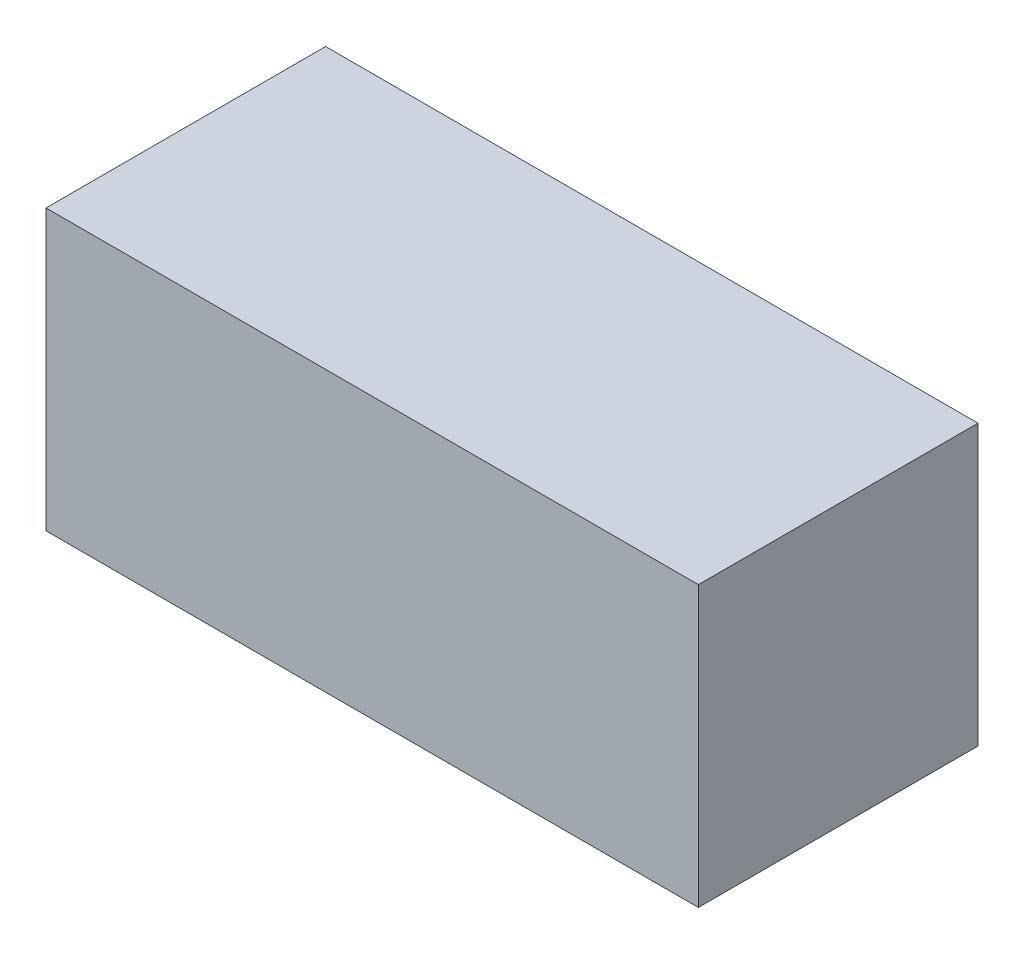
ISO-10303-21;
HEADER;
FILE_DESCRIPTION(('STEP AP214'),'2;1');
FILE_NAME('part.step','',(''),(''),'','','');
FILE_SCHEMA(('AUTOMOTIVE_DESIGN { 1 0 10303 214 1 1 1 1 }'));
ENDSEC;
DATA;
#1=APPLICATION_CONTEXT('core data for automotive mechanical design processes');
#2=APPLICATION_PROTOCOL_DEFINITION('international standard','automotive_design',2000,#1);
#3=PRODUCT_CONTEXT('',#1,'mechanical');
#4=PRODUCT('Part','Part','',(#3));
#5=PRODUCT_RELATED_PRODUCT_CATEGORY('part','',(#4));
#6=PRODUCT_DEFINITION_FORMATION('','',#4);
#7=PRODUCT_DEFINITION_CONTEXT('part definition',#1,'design');
#8=PRODUCT_DEFINITION('design','',#6,#7);
#9=PRODUCT_DEFINITION_SHAPE('','',#8);
#10=(LENGTH_UNIT() NAMED_UNIT(*) SI_UNIT(.MILLI.,.METRE.));
#11=(NAMED_UNIT(*) PLANE_ANGLE_UNIT() SI_UNIT($,.RADIAN.));
#12=(NAMED_UNIT(*) SI_UNIT($,.STERADIAN.) SOLID_ANGLE_UNIT());
#13=UNCERTAINTY_MEASURE_WITH_UNIT(LENGTH_MEASURE(1.E-05),#10,'distance_accuracy_value','');
#14=(GEOMETRIC_REPRESENTATION_CONTEXT(3) GLOBAL_UNCERTAINTY_ASSIGNED_CONTEXT((#13)) GLOBAL_UNIT_ASSIGNED_CONTEXT((#10,
#11,#12)) REPRESENTATION_CONTEXT('',''));
#15=CARTESIAN_POINT('',(0.,0.,0.));
#16=DIRECTION('',(0.,0.,1.));
#17=DIRECTION('',(1.,0.,0.));
#18=AXIS2_PLACEMENT_3D('',#15,#16,#17);
#19=CARTESIAN_POINT('',(44.45,38.1,19.05));
#20=DIRECTION('',(-1.,0.,0.));
#21=DIRECTION('',(0.,0.,1.));
#22=AXIS2_PLACEMENT_3D('',#19,#20,#21);
#23=PLANE('',#22);
#24=DIRECTION('',(0.,0.,-1.));
#25=VECTOR('',#24,1.);
#26=CARTESIAN_POINT('',(44.45,0.,19.05));
#27=LINE('',#26,#25);
#28=CARTESIAN_POINT('',(44.45,0.,19.05));
#29=VERTEX_POINT('',#28);
#30=CARTESIAN_POINT('',(44.45,0.,-19.05));
#31=VERTEX_POINT('',#30);
#32=EDGE_CURVE('E113',#29,#31,#27,.T.);
#33=ORIENTED_EDGE('',*,*,#32,.T.);
#34=DIRECTION('',(0.,-1.,0.));
#35=VECTOR('',#34,1.);
#36=CARTESIAN_POINT('',(44.45,38.1,-19.05));
#37=LINE('',#36,#35);
#38=CARTESIAN_POINT('',(44.45,38.1,-19.05));
#39=VERTEX_POINT('',#38);
#40=EDGE_CURVE('E11',#39,#31,#37,.T.);
#41=ORIENTED_EDGE('',*,*,#40,.F.);
#42=DIRECTION('',(0.,0.,-1.));
#43=VECTOR('',#42,1.);
#44=CARTESIAN_POINT('',(44.45,38.1,19.05));
#45=LINE('',#44,#43);
#46=CARTESIAN_POINT('',(44.45,38.1,19.05));
#47=VERTEX_POINT('',#46);
#48=EDGE_CURVE('E97',#47,#39,#45,.T.);
#49=ORIENTED_EDGE('',*,*,#48,.F.);
#50=DIRECTION('',(0.,-1.,0.));
#51=VECTOR('',#50,1.);
#52=CARTESIAN_POINT('',(44.45,38.1,19.05));
#53=LINE('',#52,#51);
#54=EDGE_CURVE('E109',#47,#29,#53,.T.);
#55=ORIENTED_EDGE('',*,*,#54,.T.);
#56=EDGE_LOOP('',(#33,#41,#49,#55));
#57=FACE_BOUND('',#56,.T.);
#58=ADVANCED_FACE('F45',(#57),#23,.F.);
#59=CARTESIAN_POINT('',(-44.45,38.1,-19.05));
#60=DIRECTION('',(0.,0.,1.));
#61=DIRECTION('',(1.,0.,0.));
#62=AXIS2_PLACEMENT_3D('',#59,#60,#61);
#63=PLANE('',#62);
#64=DIRECTION('',(-1.,0.,0.));
#65=VECTOR('',#64,1.);
#66=CARTESIAN_POINT('',(-44.45,0.,-19.05));
#67=LINE('',#66,#65);
#68=CARTESIAN_POINT('',(-44.45,0.,-19.05));
#69=VERTEX_POINT('',#68);
#70=EDGE_CURVE('E102',#31,#69,#67,.T.);
#71=ORIENTED_EDGE('',*,*,#70,.T.);
#72=DIRECTION('',(0.,-1.,0.));
#73=VECTOR('',#72,1.);
#74=CARTESIAN_POINT('',(-44.45,38.1,-19.05));
#75=LINE('',#74,#73);
#76=CARTESIAN_POINT('',(-44.45,38.1,-19.05));
#77=VERTEX_POINT('',#76);
#78=EDGE_CURVE('E54',#77,#69,#75,.T.);
#79=ORIENTED_EDGE('',*,*,#78,.F.);
#80=DIRECTION('',(-1.,0.,0.));
#81=VECTOR('',#80,1.);
#82=CARTESIAN_POINT('',(-44.45,38.1,-19.05));
#83=LINE('',#82,#81);
#84=EDGE_CURVE('E92',#39,#77,#83,.T.);
#85=ORIENTED_EDGE('',*,*,#84,.F.);
#86=ORIENTED_EDGE('',*,*,#40,.T.);
#87=EDGE_LOOP('',(#71,#79,#85,#86));
#88=FACE_BOUND('',#87,.T.);
#89=ADVANCED_FACE('F101',(#88),#63,.F.);
#90=CARTESIAN_POINT('',(-44.45,38.1,19.05));
#91=DIRECTION('',(1.,0.,0.));
#92=DIRECTION('',(0.,0.,-1.));
#93=AXIS2_PLACEMENT_3D('',#90,#91,#92);
#94=PLANE('',#93);
#95=DIRECTION('',(0.,0.,1.));
#96=VECTOR('',#95,1.);
#97=CARTESIAN_POINT('',(-44.45,0.,19.05));
#98=LINE('',#97,#96);
#99=CARTESIAN_POINT('',(-44.45,0.,19.05));
#100=VERTEX_POINT('',#99);
#101=EDGE_CURVE('E79',#69,#100,#98,.T.);
#102=ORIENTED_EDGE('',*,*,#101,.T.);
#103=DIRECTION('',(0.,-1.,0.));
#104=VECTOR('',#103,1.);
#105=CARTESIAN_POINT('',(-44.45,38.1,19.05));
#106=LINE('',#105,#104);
#107=CARTESIAN_POINT('',(-44.45,38.1,19.05));
#108=VERTEX_POINT('',#107);
#109=EDGE_CURVE('E104',#108,#100,#106,.T.);
#110=ORIENTED_EDGE('',*,*,#109,.F.);
#111=DIRECTION('',(0.,0.,1.));
#112=VECTOR('',#111,1.);
#113=CARTESIAN_POINT('',(-44.45,38.1,19.05));
#114=LINE('',#113,#112);
#115=EDGE_CURVE('E95',#77,#108,#114,.T.);
#116=ORIENTED_EDGE('',*,*,#115,.F.);
#117=ORIENTED_EDGE('',*,*,#78,.T.);
#118=EDGE_LOOP('',(#102,#110,#116,#117));
#119=FACE_BOUND('',#118,.T.);
#120=ADVANCED_FACE('F105',(#119),#94,.F.);
#121=CARTESIAN_POINT('',(-44.45,38.1,19.05));
#122=DIRECTION('',(0.,0.,-1.));
#123=DIRECTION('',(-1.,0.,0.));
#124=AXIS2_PLACEMENT_3D('',#121,#122,#123);
#125=PLANE('',#124);
#126=DIRECTION('',(1.,0.,0.));
#127=VECTOR('',#126,1.);
#128=CARTESIAN_POINT('',(-44.45,0.,19.05));
#129=LINE('',#128,#127);
#130=EDGE_CURVE('E85',#100,#29,#129,.T.);
#131=ORIENTED_EDGE('',*,*,#130,.T.);
#132=ORIENTED_EDGE('',*,*,#54,.F.);
#133=DIRECTION('',(1.,0.,0.));
#134=VECTOR('',#133,1.);
#135=CARTESIAN_POINT('',(-44.45,38.1,19.05));
#136=LINE('',#135,#134);
#137=EDGE_CURVE('E62',#108,#47,#136,.T.);
#138=ORIENTED_EDGE('',*,*,#137,.F.);
#139=ORIENTED_EDGE('',*,*,#109,.T.);
#140=EDGE_LOOP('',(#131,#132,#138,#139));
#141=FACE_BOUND('',#140,.T.);
#142=ADVANCED_FACE('F126',(#141),#125,.F.);
#143=CARTESIAN_POINT('',(0.,38.1,0.));
#144=DIRECTION('',(0.,-1.,0.));
#145=DIRECTION('',(0.,0.,-1.));
#146=AXIS2_PLACEMENT_3D('',#143,#144,#145);
#147=PLANE('',#146);
#148=ORIENTED_EDGE('',*,*,#48,.T.);
#149=ORIENTED_EDGE('',*,*,#84,.T.);
#150=ORIENTED_EDGE('',*,*,#115,.T.);
#151=ORIENTED_EDGE('',*,*,#137,.T.);
#152=EDGE_LOOP('',(#148,#149,#150,#151));
#153=FACE_BOUND('',#152,.T.);
#154=ADVANCED_FACE('F93',(#153),#147,.F.);
#155=CARTESIAN_POINT('',(0.,0.,0.));
#156=DIRECTION('',(0.,-1.,0.));
#157=DIRECTION('',(0.,0.,-1.));
#158=AXIS2_PLACEMENT_3D('',#155,#156,#157);
#159=PLANE('',#158);
#160=ORIENTED_EDGE('',*,*,#32,.F.);
#161=ORIENTED_EDGE('',*,*,#130,.F.);
#162=ORIENTED_EDGE('',*,*,#101,.F.);
#163=ORIENTED_EDGE('',*,*,#70,.F.);
#164=EDGE_LOOP('',(#160,#161,#162,#163));
#165=FACE_BOUND('',#164,.T.);
#166=ADVANCED_FACE('F129',(#165),#159,.T.);
#167=CLOSED_SHELL('',(#58,#89,#120,#142,#154,#166));
#168=MANIFOLD_SOLID_BREP('B2',#167);
#169=ADVANCED_BREP_SHAPE_REPRESENTATION('',(#18,#168),#14);
#170=SHAPE_DEFINITION_REPRESENTATION(#9,#169);
ENDSEC;
END-ISO-10303-21;
